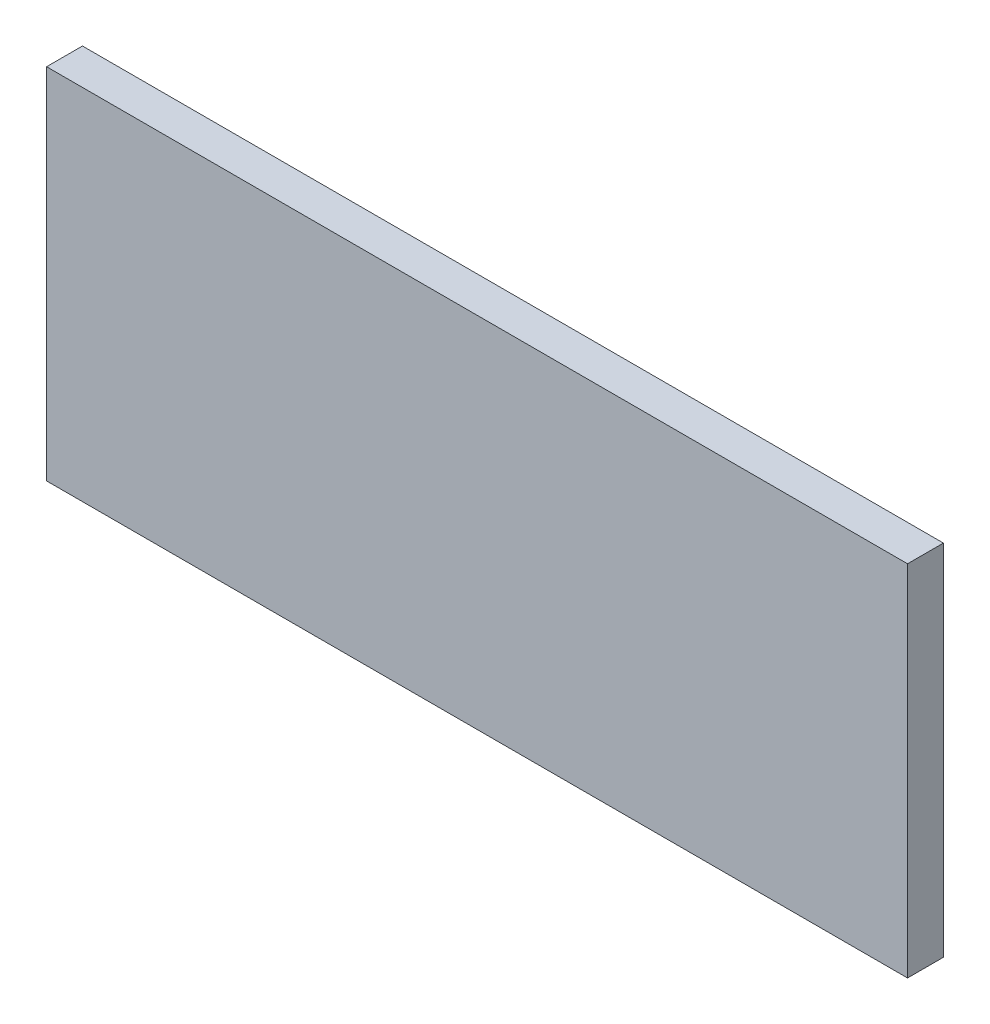
ISO-10303-21;
HEADER;
FILE_DESCRIPTION(('STEP AP214'),'2;1');
FILE_NAME('part.step','',(''),(''),'','','');
FILE_SCHEMA(('AUTOMOTIVE_DESIGN { 1 0 10303 214 1 1 1 1 }'));
ENDSEC;
DATA;
#1=APPLICATION_CONTEXT('core data for automotive mechanical design processes');
#2=APPLICATION_PROTOCOL_DEFINITION('international standard','automotive_design',2000,#1);
#3=PRODUCT_CONTEXT('',#1,'mechanical');
#4=PRODUCT('Part','Part','',(#3));
#5=PRODUCT_RELATED_PRODUCT_CATEGORY('part','',(#4));
#6=PRODUCT_DEFINITION_FORMATION('','',#4);
#7=PRODUCT_DEFINITION_CONTEXT('part definition',#1,'design');
#8=PRODUCT_DEFINITION('design','',#6,#7);
#9=PRODUCT_DEFINITION_SHAPE('','',#8);
#10=(LENGTH_UNIT() NAMED_UNIT(*) SI_UNIT(.MILLI.,.METRE.));
#11=(NAMED_UNIT(*) PLANE_ANGLE_UNIT() SI_UNIT($,.RADIAN.));
#12=(NAMED_UNIT(*) SI_UNIT($,.STERADIAN.) SOLID_ANGLE_UNIT());
#13=UNCERTAINTY_MEASURE_WITH_UNIT(LENGTH_MEASURE(1.E-05),#10,'distance_accuracy_value','');
#14=(GEOMETRIC_REPRESENTATION_CONTEXT(3) GLOBAL_UNCERTAINTY_ASSIGNED_CONTEXT((#13)) GLOBAL_UNIT_ASSIGNED_CONTEXT((#10,
#11,#12)) REPRESENTATION_CONTEXT('',''));
#15=CARTESIAN_POINT('',(0.,0.,0.));
#16=DIRECTION('',(0.,0.,1.));
#17=DIRECTION('',(1.,0.,0.));
#18=AXIS2_PLACEMENT_3D('',#15,#16,#17);
#19=CARTESIAN_POINT('',(0.,0.,12.7));
#20=DIRECTION('',(1.,0.,0.));
#21=DIRECTION('',(0.,1.,0.));
#22=AXIS2_PLACEMENT_3D('',#19,#20,#21);
#23=PLANE('',#22);
#24=DIRECTION('',(0.,-1.,0.));
#25=VECTOR('',#24,1.);
#26=CARTESIAN_POINT('',(0.,0.,0.));
#27=LINE('',#26,#25);
#28=CARTESIAN_POINT('',(0.,0.,0.));
#29=VERTEX_POINT('',#28);
#30=CARTESIAN_POINT('',(0.,-127.,0.));
#31=VERTEX_POINT('',#30);
#32=EDGE_CURVE('E98',#29,#31,#27,.T.);
#33=ORIENTED_EDGE('',*,*,#32,.T.);
#34=DIRECTION('',(0.,0.,-1.));
#35=VECTOR('',#34,1.);
#36=CARTESIAN_POINT('',(0.,-127.,12.7));
#37=LINE('',#36,#35);
#38=CARTESIAN_POINT('',(0.,-127.,12.7));
#39=VERTEX_POINT('',#38);
#40=EDGE_CURVE('E11',#39,#31,#37,.T.);
#41=ORIENTED_EDGE('',*,*,#40,.F.);
#42=DIRECTION('',(0.,-1.,0.));
#43=VECTOR('',#42,1.);
#44=CARTESIAN_POINT('',(0.,0.,12.7));
#45=LINE('',#44,#43);
#46=CARTESIAN_POINT('',(0.,0.,12.7));
#47=VERTEX_POINT('',#46);
#48=EDGE_CURVE('E86',#47,#39,#45,.T.);
#49=ORIENTED_EDGE('',*,*,#48,.F.);
#50=DIRECTION('',(0.,0.,-1.));
#51=VECTOR('',#50,1.);
#52=CARTESIAN_POINT('',(0.,0.,12.7));
#53=LINE('',#52,#51);
#54=EDGE_CURVE('E94',#47,#29,#53,.T.);
#55=ORIENTED_EDGE('',*,*,#54,.T.);
#56=EDGE_LOOP('',(#33,#41,#49,#55));
#57=FACE_BOUND('',#56,.T.);
#58=ADVANCED_FACE('F35',(#57),#23,.F.);
#59=CARTESIAN_POINT('',(0.,-127.,12.7));
#60=DIRECTION('',(0.,1.,0.));
#61=DIRECTION('',(0.,0.,1.));
#62=AXIS2_PLACEMENT_3D('',#59,#60,#61);
#63=PLANE('',#62);
#64=DIRECTION('',(1.,0.,0.));
#65=VECTOR('',#64,1.);
#66=CARTESIAN_POINT('',(0.,-127.,0.));
#67=LINE('',#66,#65);
#68=CARTESIAN_POINT('',(304.8,-127.,0.));
#69=VERTEX_POINT('',#68);
#70=EDGE_CURVE('E90',#31,#69,#67,.T.);
#71=ORIENTED_EDGE('',*,*,#70,.T.);
#72=DIRECTION('',(0.,0.,-1.));
#73=VECTOR('',#72,1.);
#74=CARTESIAN_POINT('',(304.8,-127.,12.7));
#75=LINE('',#74,#73);
#76=CARTESIAN_POINT('',(304.8,-127.,12.7));
#77=VERTEX_POINT('',#76);
#78=EDGE_CURVE('E43',#77,#69,#75,.T.);
#79=ORIENTED_EDGE('',*,*,#78,.F.);
#80=DIRECTION('',(1.,0.,0.));
#81=VECTOR('',#80,1.);
#82=CARTESIAN_POINT('',(0.,-127.,12.7));
#83=LINE('',#82,#81);
#84=EDGE_CURVE('E81',#39,#77,#83,.T.);
#85=ORIENTED_EDGE('',*,*,#84,.F.);
#86=ORIENTED_EDGE('',*,*,#40,.T.);
#87=EDGE_LOOP('',(#71,#79,#85,#86));
#88=FACE_BOUND('',#87,.T.);
#89=ADVANCED_FACE('F89',(#88),#63,.F.);
#90=CARTESIAN_POINT('',(304.8,0.,12.7));
#91=DIRECTION('',(-1.,0.,0.));
#92=DIRECTION('',(0.,-1.,0.));
#93=AXIS2_PLACEMENT_3D('',#90,#91,#92);
#94=PLANE('',#93);
#95=DIRECTION('',(0.,1.,0.));
#96=VECTOR('',#95,1.);
#97=CARTESIAN_POINT('',(304.8,0.,0.));
#98=LINE('',#97,#96);
#99=CARTESIAN_POINT('',(304.8,0.,0.));
#100=VERTEX_POINT('',#99);
#101=EDGE_CURVE('E68',#69,#100,#98,.T.);
#102=ORIENTED_EDGE('',*,*,#101,.T.);
#103=DIRECTION('',(0.,0.,-1.));
#104=VECTOR('',#103,1.);
#105=CARTESIAN_POINT('',(304.8,0.,12.7));
#106=LINE('',#105,#104);
#107=CARTESIAN_POINT('',(304.8,0.,12.7));
#108=VERTEX_POINT('',#107);
#109=EDGE_CURVE('E91',#108,#100,#106,.T.);
#110=ORIENTED_EDGE('',*,*,#109,.F.);
#111=DIRECTION('',(0.,1.,0.));
#112=VECTOR('',#111,1.);
#113=CARTESIAN_POINT('',(304.8,0.,12.7));
#114=LINE('',#113,#112);
#115=EDGE_CURVE('E84',#77,#108,#114,.T.);
#116=ORIENTED_EDGE('',*,*,#115,.F.);
#117=ORIENTED_EDGE('',*,*,#78,.T.);
#118=EDGE_LOOP('',(#102,#110,#116,#117));
#119=FACE_BOUND('',#118,.T.);
#120=ADVANCED_FACE('F92',(#119),#94,.F.);
#121=CARTESIAN_POINT('',(0.,0.,12.7));
#122=DIRECTION('',(0.,-1.,0.));
#123=DIRECTION('',(0.,0.,-1.));
#124=AXIS2_PLACEMENT_3D('',#121,#122,#123);
#125=PLANE('',#124);
#126=DIRECTION('',(-1.,0.,0.));
#127=VECTOR('',#126,1.);
#128=CARTESIAN_POINT('',(0.,0.,0.));
#129=LINE('',#128,#127);
#130=EDGE_CURVE('E74',#100,#29,#129,.T.);
#131=ORIENTED_EDGE('',*,*,#130,.T.);
#132=ORIENTED_EDGE('',*,*,#54,.F.);
#133=DIRECTION('',(-1.,0.,0.));
#134=VECTOR('',#133,1.);
#135=CARTESIAN_POINT('',(0.,0.,12.7));
#136=LINE('',#135,#134);
#137=EDGE_CURVE('E51',#108,#47,#136,.T.);
#138=ORIENTED_EDGE('',*,*,#137,.F.);
#139=ORIENTED_EDGE('',*,*,#109,.T.);
#140=EDGE_LOOP('',(#131,#132,#138,#139));
#141=FACE_BOUND('',#140,.T.);
#142=ADVANCED_FACE('F105',(#141),#125,.F.);
#143=CARTESIAN_POINT('',(0.,-127.,12.7));
#144=DIRECTION('',(0.,0.,1.));
#145=DIRECTION('',(1.,0.,0.));
#146=AXIS2_PLACEMENT_3D('',#143,#144,#145);
#147=PLANE('',#146);
#148=ORIENTED_EDGE('',*,*,#48,.T.);
#149=ORIENTED_EDGE('',*,*,#84,.T.);
#150=ORIENTED_EDGE('',*,*,#115,.T.);
#151=ORIENTED_EDGE('',*,*,#137,.T.);
#152=EDGE_LOOP('',(#148,#149,#150,#151));
#153=FACE_BOUND('',#152,.T.);
#154=ADVANCED_FACE('F82',(#153),#147,.T.);
#155=CARTESIAN_POINT('',(0.,-127.,0.));
#156=DIRECTION('',(0.,0.,1.));
#157=DIRECTION('',(1.,0.,0.));
#158=AXIS2_PLACEMENT_3D('',#155,#156,#157);
#159=PLANE('',#158);
#160=ORIENTED_EDGE('',*,*,#32,.F.);
#161=ORIENTED_EDGE('',*,*,#130,.F.);
#162=ORIENTED_EDGE('',*,*,#101,.F.);
#163=ORIENTED_EDGE('',*,*,#70,.F.);
#164=EDGE_LOOP('',(#160,#161,#162,#163));
#165=FACE_BOUND('',#164,.T.);
#166=ADVANCED_FACE('F108',(#165),#159,.F.);
#167=CLOSED_SHELL('',(#58,#89,#120,#142,#154,#166));
#168=MANIFOLD_SOLID_BREP('B2',#167);
#169=ADVANCED_BREP_SHAPE_REPRESENTATION('',(#18,#168),#14);
#170=SHAPE_DEFINITION_REPRESENTATION(#9,#169);
ENDSEC;
END-ISO-10303-21;
